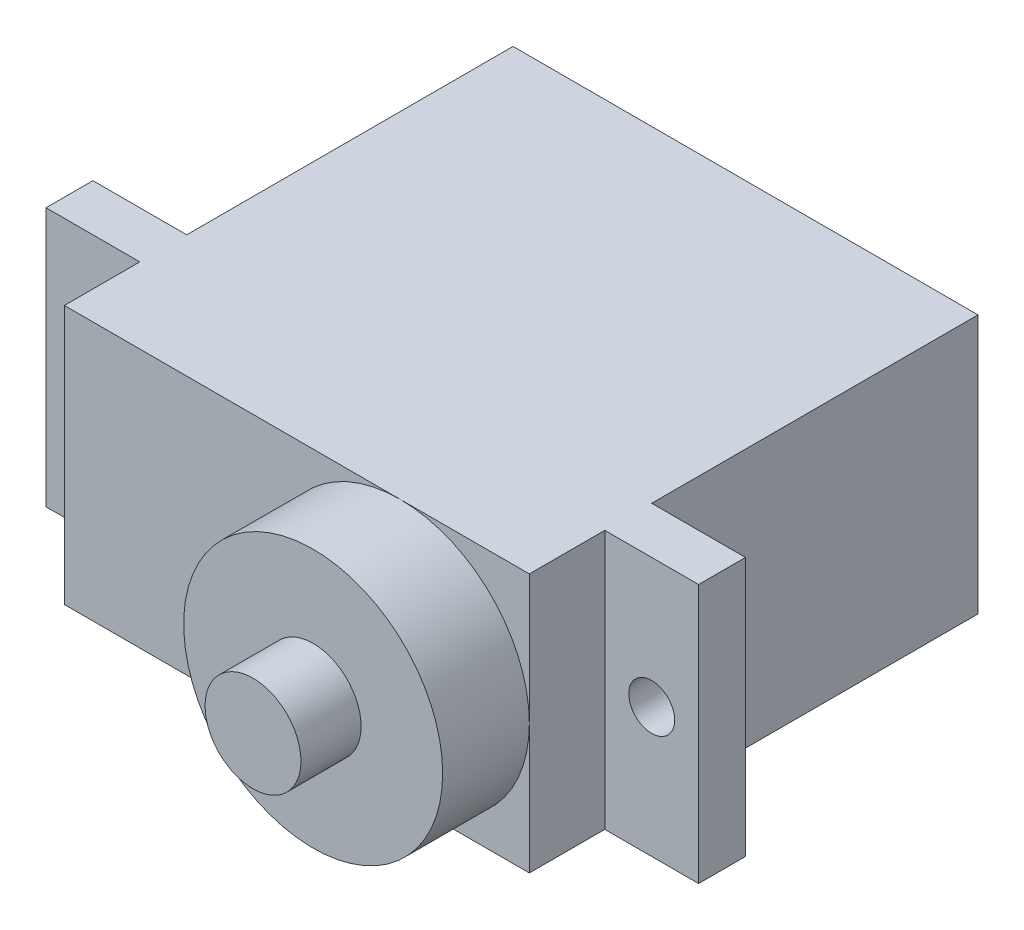
ISO-10303-21;
HEADER;
FILE_DESCRIPTION(('STEP AP214'),'2;1');
FILE_NAME('part.step','',(''),(''),'','','');
FILE_SCHEMA(('AUTOMOTIVE_DESIGN { 1 0 10303 214 1 1 1 1 }'));
ENDSEC;
DATA;
#1=APPLICATION_CONTEXT('core data for automotive mechanical design processes');
#2=APPLICATION_PROTOCOL_DEFINITION('international standard','automotive_design',2000,#1);
#3=PRODUCT_CONTEXT('',#1,'mechanical');
#4=PRODUCT('Part','Part','',(#3));
#5=PRODUCT_RELATED_PRODUCT_CATEGORY('part','',(#4));
#6=PRODUCT_DEFINITION_FORMATION('','',#4);
#7=PRODUCT_DEFINITION_CONTEXT('part definition',#1,'design');
#8=PRODUCT_DEFINITION('design','',#6,#7);
#9=PRODUCT_DEFINITION_SHAPE('','',#8);
#10=(LENGTH_UNIT() NAMED_UNIT(*) SI_UNIT(.MILLI.,.METRE.));
#11=(NAMED_UNIT(*) PLANE_ANGLE_UNIT() SI_UNIT($,.RADIAN.));
#12=(NAMED_UNIT(*) SI_UNIT($,.STERADIAN.) SOLID_ANGLE_UNIT());
#13=UNCERTAINTY_MEASURE_WITH_UNIT(LENGTH_MEASURE(1.E-05),#10,'distance_accuracy_value','');
#14=(GEOMETRIC_REPRESENTATION_CONTEXT(3) GLOBAL_UNCERTAINTY_ASSIGNED_CONTEXT((#13)) GLOBAL_UNIT_ASSIGNED_CONTEXT((#10,
#11,#12)) REPRESENTATION_CONTEXT('',''));
#15=CARTESIAN_POINT('',(0.,0.,0.));
#16=DIRECTION('',(0.,0.,1.));
#17=DIRECTION('',(1.,0.,0.));
#18=AXIS2_PLACEMENT_3D('',#15,#16,#17);
#19=CARTESIAN_POINT('',(0.,0.,22.));
#20=DIRECTION('',(0.,0.,-1.));
#21=DIRECTION('',(-1.,0.,0.));
#22=AXIS2_PLACEMENT_3D('',#19,#20,#21);
#23=PLANE('',#22);
#24=CARTESIAN_POINT('',(5.05,0.,22.));
#25=DIRECTION('',(0.,0.,1.));
#26=DIRECTION('',(1.,0.,0.));
#27=AXIS2_PLACEMENT_3D('',#24,#25,#26);
#28=CIRCLE('',#27,6.35);
#29=CARTESIAN_POINT('',(5.05,-6.35,22.));
#30=VERTEX_POINT('',#29);
#31=CARTESIAN_POINT('',(11.4,0.,22.));
#32=VERTEX_POINT('',#31);
#33=EDGE_CURVE('E168',#30,#32,#28,.T.);
#34=ORIENTED_EDGE('',*,*,#33,.F.);
#35=DIRECTION('',(1.,0.,0.));
#36=VECTOR('',#35,1.);
#37=CARTESIAN_POINT('',(-11.4,-6.35,22.));
#38=LINE('',#37,#36);
#39=CARTESIAN_POINT('',(11.4,-6.35,22.));
#40=VERTEX_POINT('',#39);
#41=EDGE_CURVE('E153',#30,#40,#38,.T.);
#42=ORIENTED_EDGE('',*,*,#41,.T.);
#43=DIRECTION('',(0.,1.,0.));
#44=VECTOR('',#43,1.);
#45=CARTESIAN_POINT('',(11.4,-6.35,22.));
#46=LINE('',#45,#44);
#47=EDGE_CURVE('E166',#40,#32,#46,.T.);
#48=ORIENTED_EDGE('',*,*,#47,.T.);
#49=EDGE_LOOP('',(#34,#42,#48));
#50=FACE_BOUND('',#49,.T.);
#51=ADVANCED_FACE('F43',(#50),#23,.F.);
#52=CARTESIAN_POINT('',(5.05,6.35,22.));
#53=VERTEX_POINT('',#52);
#54=EDGE_CURVE('E68',#32,#53,#28,.T.);
#55=ORIENTED_EDGE('',*,*,#54,.F.);
#56=CARTESIAN_POINT('',(11.4,6.35,22.));
#57=VERTEX_POINT('',#56);
#58=EDGE_CURVE('E277',#32,#57,#46,.T.);
#59=ORIENTED_EDGE('',*,*,#58,.T.);
#60=DIRECTION('',(1.,0.,0.));
#61=VECTOR('',#60,1.);
#62=CARTESIAN_POINT('',(-11.4,6.35,22.));
#63=LINE('',#62,#61);
#64=EDGE_CURVE('E271',#53,#57,#63,.T.);
#65=ORIENTED_EDGE('',*,*,#64,.F.);
#66=EDGE_LOOP('',(#55,#59,#65));
#67=FACE_BOUND('',#66,.T.);
#68=ADVANCED_FACE('F341',(#67),#23,.F.);
#69=CARTESIAN_POINT('',(-11.4,-6.35,22.));
#70=DIRECTION('',(-1.,0.,0.));
#71=DIRECTION('',(0.,0.,1.));
#72=AXIS2_PLACEMENT_3D('',#69,#70,#71);
#73=PLANE('',#72);
#74=DIRECTION('',(0.,0.,-1.));
#75=VECTOR('',#74,1.);
#76=CARTESIAN_POINT('',(-11.4,-6.35,22.));
#77=LINE('',#76,#75);
#78=CARTESIAN_POINT('',(-11.4,-6.35,16.));
#79=VERTEX_POINT('',#78);
#80=CARTESIAN_POINT('',(-11.4,-6.35,0.));
#81=VERTEX_POINT('',#80);
#82=EDGE_CURVE('E53',#79,#81,#77,.T.);
#83=ORIENTED_EDGE('',*,*,#82,.F.);
#84=DIRECTION('',(0.,1.,0.));
#85=VECTOR('',#84,1.);
#86=CARTESIAN_POINT('',(-11.4,0.,16.));
#87=LINE('',#86,#85);
#88=CARTESIAN_POINT('',(-11.4,6.35,16.));
#89=VERTEX_POINT('',#88);
#90=EDGE_CURVE('E188',#79,#89,#87,.T.);
#91=ORIENTED_EDGE('',*,*,#90,.T.);
#92=DIRECTION('',(0.,0.,-1.));
#93=VECTOR('',#92,1.);
#94=CARTESIAN_POINT('',(-11.4,6.35,22.));
#95=LINE('',#94,#93);
#96=CARTESIAN_POINT('',(-11.4,6.35,0.));
#97=VERTEX_POINT('',#96);
#98=EDGE_CURVE('E152',#89,#97,#95,.T.);
#99=ORIENTED_EDGE('',*,*,#98,.T.);
#100=DIRECTION('',(0.,1.,0.));
#101=VECTOR('',#100,1.);
#102=CARTESIAN_POINT('',(-11.4,-6.35,0.));
#103=LINE('',#102,#101);
#104=EDGE_CURVE('E266',#81,#97,#103,.T.);
#105=ORIENTED_EDGE('',*,*,#104,.F.);
#106=EDGE_LOOP('',(#83,#91,#99,#105));
#107=FACE_BOUND('',#106,.T.);
#108=ADVANCED_FACE('F309',(#107),#73,.T.);
#109=CARTESIAN_POINT('',(11.4,-6.35,22.));
#110=DIRECTION('',(-1.,0.,0.));
#111=DIRECTION('',(0.,0.,1.));
#112=AXIS2_PLACEMENT_3D('',#109,#110,#111);
#113=PLANE('',#112);
#114=DIRECTION('',(0.,1.,0.));
#115=VECTOR('',#114,1.);
#116=CARTESIAN_POINT('',(11.4,0.,16.));
#117=LINE('',#116,#115);
#118=CARTESIAN_POINT('',(11.4,-6.35,16.));
#119=VERTEX_POINT('',#118);
#120=CARTESIAN_POINT('',(11.4,6.35,16.));
#121=VERTEX_POINT('',#120);
#122=EDGE_CURVE('E257',#119,#121,#117,.T.);
#123=ORIENTED_EDGE('',*,*,#122,.F.);
#124=DIRECTION('',(0.,0.,-1.));
#125=VECTOR('',#124,1.);
#126=CARTESIAN_POINT('',(11.4,-6.35,22.));
#127=LINE('',#126,#125);
#128=CARTESIAN_POINT('',(11.4,-6.35,0.));
#129=VERTEX_POINT('',#128);
#130=EDGE_CURVE('E295',#119,#129,#127,.T.);
#131=ORIENTED_EDGE('',*,*,#130,.T.);
#132=DIRECTION('',(0.,1.,0.));
#133=VECTOR('',#132,1.);
#134=CARTESIAN_POINT('',(11.4,-6.35,0.));
#135=LINE('',#134,#133);
#136=CARTESIAN_POINT('',(11.4,6.35,0.));
#137=VERTEX_POINT('',#136);
#138=EDGE_CURVE('E287',#129,#137,#135,.T.);
#139=ORIENTED_EDGE('',*,*,#138,.T.);
#140=DIRECTION('',(0.,0.,-1.));
#141=VECTOR('',#140,1.);
#142=CARTESIAN_POINT('',(11.4,6.35,22.));
#143=LINE('',#142,#141);
#144=EDGE_CURVE('E299',#121,#137,#143,.T.);
#145=ORIENTED_EDGE('',*,*,#144,.F.);
#146=EDGE_LOOP('',(#123,#131,#139,#145));
#147=FACE_BOUND('',#146,.T.);
#148=ADVANCED_FACE('F327',(#147),#113,.F.);
#149=DIRECTION('',(0.,1.,0.));
#150=VECTOR('',#149,1.);
#151=CARTESIAN_POINT('',(-11.4,0.,18.3));
#152=LINE('',#151,#150);
#153=CARTESIAN_POINT('',(-11.4,-6.35,18.3));
#154=VERTEX_POINT('',#153);
#155=CARTESIAN_POINT('',(-11.4,6.35,18.3));
#156=VERTEX_POINT('',#155);
#157=EDGE_CURVE('E198',#154,#156,#152,.T.);
#158=ORIENTED_EDGE('',*,*,#157,.F.);
#159=CARTESIAN_POINT('',(-11.4,-6.35,22.));
#160=VERTEX_POINT('',#159);
#161=EDGE_CURVE('E12',#160,#154,#77,.T.);
#162=ORIENTED_EDGE('',*,*,#161,.F.);
#163=DIRECTION('',(0.,1.,0.));
#164=VECTOR('',#163,1.);
#165=CARTESIAN_POINT('',(-11.4,-6.35,22.));
#166=LINE('',#165,#164);
#167=CARTESIAN_POINT('',(-11.4,6.35,22.));
#168=VERTEX_POINT('',#167);
#169=EDGE_CURVE('E149',#160,#168,#166,.T.);
#170=ORIENTED_EDGE('',*,*,#169,.T.);
#171=EDGE_CURVE('E300',#168,#156,#95,.T.);
#172=ORIENTED_EDGE('',*,*,#171,.T.);
#173=EDGE_LOOP('',(#158,#162,#170,#172));
#174=FACE_BOUND('',#173,.T.);
#175=ADVANCED_FACE('F45',(#174),#73,.T.);
#176=CARTESIAN_POINT('',(-11.4,-6.35,22.));
#177=DIRECTION('',(0.,1.,0.));
#178=DIRECTION('',(0.,0.,1.));
#179=AXIS2_PLACEMENT_3D('',#176,#177,#178);
#180=PLANE('',#179);
#181=DIRECTION('',(1.,0.,0.));
#182=VECTOR('',#181,1.);
#183=CARTESIAN_POINT('',(-11.4,-6.35,0.));
#184=LINE('',#183,#182);
#185=EDGE_CURVE('E272',#81,#129,#184,.T.);
#186=ORIENTED_EDGE('',*,*,#185,.T.);
#187=ORIENTED_EDGE('',*,*,#130,.F.);
#188=DIRECTION('',(-1.,0.,0.));
#189=VECTOR('',#188,1.);
#190=CARTESIAN_POINT('',(0.,-6.35,16.));
#191=LINE('',#190,#189);
#192=CARTESIAN_POINT('',(16.,-6.35,16.));
#193=VERTEX_POINT('',#192);
#194=EDGE_CURVE('E254',#193,#119,#191,.T.);
#195=ORIENTED_EDGE('',*,*,#194,.F.);
#196=DIRECTION('',(0.,0.,-1.));
#197=VECTOR('',#196,1.);
#198=CARTESIAN_POINT('',(16.,-6.35,18.3));
#199=LINE('',#198,#197);
#200=CARTESIAN_POINT('',(16.,-6.35,18.3));
#201=VERTEX_POINT('',#200);
#202=EDGE_CURVE('E246',#201,#193,#199,.T.);
#203=ORIENTED_EDGE('',*,*,#202,.F.);
#204=DIRECTION('',(-1.,0.,0.));
#205=VECTOR('',#204,1.);
#206=CARTESIAN_POINT('',(0.,-6.35,18.3));
#207=LINE('',#206,#205);
#208=CARTESIAN_POINT('',(11.4,-6.35,18.3));
#209=VERTEX_POINT('',#208);
#210=EDGE_CURVE('E235',#201,#209,#207,.T.);
#211=ORIENTED_EDGE('',*,*,#210,.T.);
#212=EDGE_CURVE('E161',#40,#209,#127,.T.);
#213=ORIENTED_EDGE('',*,*,#212,.F.);
#214=ORIENTED_EDGE('',*,*,#41,.F.);
#215=EDGE_CURVE('E145',#160,#30,#38,.T.);
#216=ORIENTED_EDGE('',*,*,#215,.F.);
#217=ORIENTED_EDGE('',*,*,#161,.T.);
#218=DIRECTION('',(1.,0.,0.));
#219=VECTOR('',#218,1.);
#220=CARTESIAN_POINT('',(0.,-6.35,18.3));
#221=LINE('',#220,#219);
#222=CARTESIAN_POINT('',(-16.,-6.35,18.3));
#223=VERTEX_POINT('',#222);
#224=EDGE_CURVE('E187',#223,#154,#221,.T.);
#225=ORIENTED_EDGE('',*,*,#224,.F.);
#226=DIRECTION('',(0.,0.,-1.));
#227=VECTOR('',#226,1.);
#228=CARTESIAN_POINT('',(-16.,-6.35,18.3));
#229=LINE('',#228,#227);
#230=CARTESIAN_POINT('',(-16.,-6.35,16.));
#231=VERTEX_POINT('',#230);
#232=EDGE_CURVE('E202',#223,#231,#229,.T.);
#233=ORIENTED_EDGE('',*,*,#232,.T.);
#234=DIRECTION('',(1.,0.,0.));
#235=VECTOR('',#234,1.);
#236=CARTESIAN_POINT('',(0.,-6.35,16.));
#237=LINE('',#236,#235);
#238=EDGE_CURVE('E206',#231,#79,#237,.T.);
#239=ORIENTED_EDGE('',*,*,#238,.T.);
#240=ORIENTED_EDGE('',*,*,#82,.T.);
#241=EDGE_LOOP('',(#186,#187,#195,#203,#211,#213,#214,#216,#217,#225,#233,#239,#240));
#242=FACE_BOUND('',#241,.T.);
#243=ADVANCED_FACE('F158',(#242),#180,.F.);
#244=ORIENTED_EDGE('',*,*,#212,.T.);
#245=DIRECTION('',(0.,1.,0.));
#246=VECTOR('',#245,1.);
#247=CARTESIAN_POINT('',(11.4,0.,18.3));
#248=LINE('',#247,#246);
#249=CARTESIAN_POINT('',(11.4,6.35,18.3));
#250=VERTEX_POINT('',#249);
#251=EDGE_CURVE('E238',#209,#250,#248,.T.);
#252=ORIENTED_EDGE('',*,*,#251,.T.);
#253=EDGE_CURVE('E296',#57,#250,#143,.T.);
#254=ORIENTED_EDGE('',*,*,#253,.F.);
#255=ORIENTED_EDGE('',*,*,#58,.F.);
#256=ORIENTED_EDGE('',*,*,#47,.F.);
#257=EDGE_LOOP('',(#244,#252,#254,#255,#256));
#258=FACE_BOUND('',#257,.T.);
#259=ADVANCED_FACE('F339',(#258),#113,.F.);
#260=CARTESIAN_POINT('',(-11.4,6.35,22.));
#261=DIRECTION('',(0.,1.,0.));
#262=DIRECTION('',(0.,0.,1.));
#263=AXIS2_PLACEMENT_3D('',#260,#261,#262);
#264=PLANE('',#263);
#265=DIRECTION('',(1.,0.,0.));
#266=VECTOR('',#265,1.);
#267=CARTESIAN_POINT('',(-11.4,6.35,0.));
#268=LINE('',#267,#266);
#269=EDGE_CURVE('E283',#97,#137,#268,.T.);
#270=ORIENTED_EDGE('',*,*,#269,.F.);
#271=ORIENTED_EDGE('',*,*,#98,.F.);
#272=DIRECTION('',(-1.,0.,0.));
#273=VECTOR('',#272,1.);
#274=CARTESIAN_POINT('',(0.,6.35,16.));
#275=LINE('',#274,#273);
#276=CARTESIAN_POINT('',(-16.,6.35,16.));
#277=VERTEX_POINT('',#276);
#278=EDGE_CURVE('E213',#89,#277,#275,.T.);
#279=ORIENTED_EDGE('',*,*,#278,.T.);
#280=DIRECTION('',(0.,0.,-1.));
#281=VECTOR('',#280,1.);
#282=CARTESIAN_POINT('',(-16.,6.35,18.3));
#283=LINE('',#282,#281);
#284=CARTESIAN_POINT('',(-16.,6.35,18.3));
#285=VERTEX_POINT('',#284);
#286=EDGE_CURVE('E218',#285,#277,#283,.T.);
#287=ORIENTED_EDGE('',*,*,#286,.F.);
#288=DIRECTION('',(-1.,0.,0.));
#289=VECTOR('',#288,1.);
#290=CARTESIAN_POINT('',(0.,6.35,18.3));
#291=LINE('',#290,#289);
#292=EDGE_CURVE('E195',#156,#285,#291,.T.);
#293=ORIENTED_EDGE('',*,*,#292,.F.);
#294=ORIENTED_EDGE('',*,*,#171,.F.);
#295=EDGE_CURVE('E273',#168,#53,#63,.T.);
#296=ORIENTED_EDGE('',*,*,#295,.T.);
#297=ORIENTED_EDGE('',*,*,#64,.T.);
#298=ORIENTED_EDGE('',*,*,#253,.T.);
#299=DIRECTION('',(1.,0.,0.));
#300=VECTOR('',#299,1.);
#301=CARTESIAN_POINT('',(0.,6.35,18.3));
#302=LINE('',#301,#300);
#303=CARTESIAN_POINT('',(16.,6.35,18.3));
#304=VERTEX_POINT('',#303);
#305=EDGE_CURVE('E242',#250,#304,#302,.T.);
#306=ORIENTED_EDGE('',*,*,#305,.T.);
#307=DIRECTION('',(0.,0.,-1.));
#308=VECTOR('',#307,1.);
#309=CARTESIAN_POINT('',(16.,6.35,18.3));
#310=LINE('',#309,#308);
#311=CARTESIAN_POINT('',(16.,6.35,16.));
#312=VERTEX_POINT('',#311);
#313=EDGE_CURVE('E263',#304,#312,#310,.T.);
#314=ORIENTED_EDGE('',*,*,#313,.T.);
#315=DIRECTION('',(1.,0.,0.));
#316=VECTOR('',#315,1.);
#317=CARTESIAN_POINT('',(0.,6.35,16.));
#318=LINE('',#317,#316);
#319=EDGE_CURVE('E231',#121,#312,#318,.T.);
#320=ORIENTED_EDGE('',*,*,#319,.F.);
#321=ORIENTED_EDGE('',*,*,#144,.T.);
#322=EDGE_LOOP('',(#270,#271,#279,#287,#293,#294,#296,#297,#298,#306,#314,#320,#321));
#323=FACE_BOUND('',#322,.T.);
#324=ADVANCED_FACE('F313',(#323),#264,.T.);
#325=EDGE_CURVE('E61',#53,#30,#28,.T.);
#326=ORIENTED_EDGE('',*,*,#325,.F.);
#327=ORIENTED_EDGE('',*,*,#295,.F.);
#328=ORIENTED_EDGE('',*,*,#169,.F.);
#329=ORIENTED_EDGE('',*,*,#215,.T.);
#330=EDGE_LOOP('',(#326,#327,#328,#329));
#331=FACE_BOUND('',#330,.T.);
#332=ADVANCED_FACE('F147',(#331),#23,.F.);
#333=CARTESIAN_POINT('',(0.,0.,0.));
#334=DIRECTION('',(0.,0.,-1.));
#335=DIRECTION('',(-1.,0.,0.));
#336=AXIS2_PLACEMENT_3D('',#333,#334,#335);
#337=PLANE('',#336);
#338=ORIENTED_EDGE('',*,*,#104,.T.);
#339=ORIENTED_EDGE('',*,*,#269,.T.);
#340=ORIENTED_EDGE('',*,*,#138,.F.);
#341=ORIENTED_EDGE('',*,*,#185,.F.);
#342=EDGE_LOOP('',(#338,#339,#340,#341));
#343=FACE_BOUND('',#342,.T.);
#344=ADVANCED_FACE('F319',(#343),#337,.T.);
#345=CARTESIAN_POINT('',(16.,0.,18.3));
#346=DIRECTION('',(1.,0.,0.));
#347=DIRECTION('',(0.,0.,-1.));
#348=AXIS2_PLACEMENT_3D('',#345,#346,#347);
#349=PLANE('',#348);
#350=DIRECTION('',(0.,-1.,0.));
#351=VECTOR('',#350,1.);
#352=CARTESIAN_POINT('',(16.,0.,16.));
#353=LINE('',#352,#351);
#354=EDGE_CURVE('E250',#312,#193,#353,.T.);
#355=ORIENTED_EDGE('',*,*,#354,.F.);
#356=ORIENTED_EDGE('',*,*,#313,.F.);
#357=DIRECTION('',(0.,-1.,0.));
#358=VECTOR('',#357,1.);
#359=CARTESIAN_POINT('',(16.,0.,18.3));
#360=LINE('',#359,#358);
#361=EDGE_CURVE('E230',#304,#201,#360,.T.);
#362=ORIENTED_EDGE('',*,*,#361,.T.);
#363=ORIENTED_EDGE('',*,*,#202,.T.);
#364=EDGE_LOOP('',(#355,#356,#362,#363));
#365=FACE_BOUND('',#364,.T.);
#366=ADVANCED_FACE('F333',(#365),#349,.T.);
#367=CARTESIAN_POINT('',(13.7,0.,18.3));
#368=DIRECTION('',(0.,0.,-1.));
#369=DIRECTION('',(-1.,0.,0.));
#370=AXIS2_PLACEMENT_3D('',#367,#368,#369);
#371=CYLINDRICAL_SURFACE('',#370,1.125);
#372=CARTESIAN_POINT('',(13.7,0.,18.3));
#373=DIRECTION('',(0.,0.,-1.));
#374=DIRECTION('',(-1.,0.,0.));
#375=AXIS2_PLACEMENT_3D('',#372,#373,#374);
#376=CIRCLE('',#375,1.125);
#377=CARTESIAN_POINT('',(12.575,0.,18.3));
#378=VERTEX_POINT('',#377);
#379=EDGE_CURVE('E226',#378,#378,#376,.T.);
#380=ORIENTED_EDGE('',*,*,#379,.F.);
#381=EDGE_LOOP('',(#380));
#382=FACE_BOUND('',#381,.T.);
#383=CARTESIAN_POINT('',(13.7,0.,16.));
#384=DIRECTION('',(0.,0.,-1.));
#385=DIRECTION('',(-1.,0.,0.));
#386=AXIS2_PLACEMENT_3D('',#383,#384,#385);
#387=CIRCLE('',#386,1.125);
#388=CARTESIAN_POINT('',(12.575,0.,16.));
#389=VERTEX_POINT('',#388);
#390=EDGE_CURVE('E222',#389,#389,#387,.T.);
#391=ORIENTED_EDGE('',*,*,#390,.T.);
#392=EDGE_LOOP('',(#391));
#393=FACE_BOUND('',#392,.T.);
#394=ADVANCED_FACE('F414',(#382,#393),#371,.F.);
#395=CARTESIAN_POINT('',(0.,0.,18.3));
#396=DIRECTION('',(0.,0.,-1.));
#397=DIRECTION('',(-1.,0.,0.));
#398=AXIS2_PLACEMENT_3D('',#395,#396,#397);
#399=PLANE('',#398);
#400=ORIENTED_EDGE('',*,*,#379,.T.);
#401=EDGE_LOOP('',(#400));
#402=FACE_BOUND('',#401,.T.);
#403=ORIENTED_EDGE('',*,*,#361,.F.);
#404=ORIENTED_EDGE('',*,*,#305,.F.);
#405=ORIENTED_EDGE('',*,*,#251,.F.);
#406=ORIENTED_EDGE('',*,*,#210,.F.);
#407=EDGE_LOOP('',(#403,#404,#405,#406));
#408=FACE_BOUND('',#407,.T.);
#409=ADVANCED_FACE('F336',(#402,#408),#399,.F.);
#410=CARTESIAN_POINT('',(0.,0.,16.));
#411=DIRECTION('',(0.,0.,-1.));
#412=DIRECTION('',(-1.,0.,0.));
#413=AXIS2_PLACEMENT_3D('',#410,#411,#412);
#414=PLANE('',#413);
#415=ORIENTED_EDGE('',*,*,#390,.F.);
#416=EDGE_LOOP('',(#415));
#417=FACE_BOUND('',#416,.T.);
#418=ORIENTED_EDGE('',*,*,#354,.T.);
#419=ORIENTED_EDGE('',*,*,#194,.T.);
#420=ORIENTED_EDGE('',*,*,#122,.T.);
#421=ORIENTED_EDGE('',*,*,#319,.T.);
#422=EDGE_LOOP('',(#418,#419,#420,#421));
#423=FACE_BOUND('',#422,.T.);
#424=ADVANCED_FACE('F329',(#417,#423),#414,.T.);
#425=CARTESIAN_POINT('',(-13.7,0.,18.3));
#426=DIRECTION('',(0.,0.,-1.));
#427=DIRECTION('',(-1.,0.,0.));
#428=AXIS2_PLACEMENT_3D('',#425,#426,#427);
#429=CYLINDRICAL_SURFACE('',#428,1.125);
#430=CARTESIAN_POINT('',(-13.7,0.,18.3));
#431=DIRECTION('',(0.,0.,-1.));
#432=DIRECTION('',(-1.,0.,0.));
#433=AXIS2_PLACEMENT_3D('',#430,#431,#432);
#434=CIRCLE('',#433,1.125);
#435=CARTESIAN_POINT('',(-14.825,0.,18.3));
#436=VERTEX_POINT('',#435);
#437=EDGE_CURVE('E183',#436,#436,#434,.T.);
#438=ORIENTED_EDGE('',*,*,#437,.F.);
#439=EDGE_LOOP('',(#438));
#440=FACE_BOUND('',#439,.T.);
#441=CARTESIAN_POINT('',(-13.7,0.,16.));
#442=DIRECTION('',(0.,0.,-1.));
#443=DIRECTION('',(-1.,0.,0.));
#444=AXIS2_PLACEMENT_3D('',#441,#442,#443);
#445=CIRCLE('',#444,1.125);
#446=CARTESIAN_POINT('',(-14.825,0.,16.));
#447=VERTEX_POINT('',#446);
#448=EDGE_CURVE('E182',#447,#447,#445,.T.);
#449=ORIENTED_EDGE('',*,*,#448,.T.);
#450=EDGE_LOOP('',(#449));
#451=FACE_BOUND('',#450,.T.);
#452=ADVANCED_FACE('F441',(#440,#451),#429,.F.);
#453=CARTESIAN_POINT('',(-16.,0.,18.3));
#454=DIRECTION('',(1.,0.,0.));
#455=DIRECTION('',(0.,0.,-1.));
#456=AXIS2_PLACEMENT_3D('',#453,#454,#455);
#457=PLANE('',#456);
#458=DIRECTION('',(0.,-1.,0.));
#459=VECTOR('',#458,1.);
#460=CARTESIAN_POINT('',(-16.,0.,16.));
#461=LINE('',#460,#459);
#462=EDGE_CURVE('E210',#277,#231,#461,.T.);
#463=ORIENTED_EDGE('',*,*,#462,.T.);
#464=ORIENTED_EDGE('',*,*,#232,.F.);
#465=DIRECTION('',(0.,-1.,0.));
#466=VECTOR('',#465,1.);
#467=CARTESIAN_POINT('',(-16.,0.,18.3));
#468=LINE('',#467,#466);
#469=EDGE_CURVE('E192',#285,#223,#468,.T.);
#470=ORIENTED_EDGE('',*,*,#469,.F.);
#471=ORIENTED_EDGE('',*,*,#286,.T.);
#472=EDGE_LOOP('',(#463,#464,#470,#471));
#473=FACE_BOUND('',#472,.T.);
#474=ADVANCED_FACE('F451',(#473),#457,.F.);
#475=CARTESIAN_POINT('',(0.,0.,18.3));
#476=DIRECTION('',(0.,0.,-1.));
#477=DIRECTION('',(-1.,0.,0.));
#478=AXIS2_PLACEMENT_3D('',#475,#476,#477);
#479=PLANE('',#478);
#480=ORIENTED_EDGE('',*,*,#437,.T.);
#481=EDGE_LOOP('',(#480));
#482=FACE_BOUND('',#481,.T.);
#483=ORIENTED_EDGE('',*,*,#224,.T.);
#484=ORIENTED_EDGE('',*,*,#157,.T.);
#485=ORIENTED_EDGE('',*,*,#292,.T.);
#486=ORIENTED_EDGE('',*,*,#469,.T.);
#487=EDGE_LOOP('',(#483,#484,#485,#486));
#488=FACE_BOUND('',#487,.T.);
#489=ADVANCED_FACE('F361',(#482,#488),#479,.F.);
#490=CARTESIAN_POINT('',(0.,0.,16.));
#491=DIRECTION('',(0.,0.,-1.));
#492=DIRECTION('',(-1.,0.,0.));
#493=AXIS2_PLACEMENT_3D('',#490,#491,#492);
#494=PLANE('',#493);
#495=ORIENTED_EDGE('',*,*,#448,.F.);
#496=EDGE_LOOP('',(#495));
#497=FACE_BOUND('',#496,.T.);
#498=ORIENTED_EDGE('',*,*,#238,.F.);
#499=ORIENTED_EDGE('',*,*,#462,.F.);
#500=ORIENTED_EDGE('',*,*,#278,.F.);
#501=ORIENTED_EDGE('',*,*,#90,.F.);
#502=EDGE_LOOP('',(#498,#499,#500,#501));
#503=FACE_BOUND('',#502,.T.);
#504=ADVANCED_FACE('F352',(#497,#503),#494,.T.);
#505=CARTESIAN_POINT('',(5.05,0.,26.25));
#506=DIRECTION('',(0.,0.,-1.));
#507=DIRECTION('',(-1.,0.,0.));
#508=AXIS2_PLACEMENT_3D('',#505,#506,#507);
#509=CYLINDRICAL_SURFACE('',#508,6.35);
#510=CARTESIAN_POINT('',(5.05,0.,26.25));
#511=DIRECTION('',(0.,0.,1.));
#512=DIRECTION('',(1.,0.,0.));
#513=AXIS2_PLACEMENT_3D('',#510,#511,#512);
#514=CIRCLE('',#513,6.35);
#515=CARTESIAN_POINT('',(11.4,0.,26.25));
#516=VERTEX_POINT('',#515);
#517=EDGE_CURVE('E175',#516,#516,#514,.T.);
#518=ORIENTED_EDGE('',*,*,#517,.F.);
#519=EDGE_LOOP('',(#518));
#520=FACE_BOUND('',#519,.T.);
#521=ORIENTED_EDGE('',*,*,#54,.T.);
#522=ORIENTED_EDGE('',*,*,#325,.T.);
#523=ORIENTED_EDGE('',*,*,#33,.T.);
#524=EDGE_LOOP('',(#521,#522,#523));
#525=FACE_BOUND('',#524,.T.);
#526=ADVANCED_FACE('F172',(#520,#525),#509,.T.);
#527=CARTESIAN_POINT('',(5.05,0.,26.25));
#528=DIRECTION('',(0.,0.,1.));
#529=DIRECTION('',(1.,0.,0.));
#530=AXIS2_PLACEMENT_3D('',#527,#528,#529);
#531=PLANE('',#530);
#532=CARTESIAN_POINT('',(5.05,0.,26.25));
#533=DIRECTION('',(0.,0.,1.));
#534=DIRECTION('',(1.,0.,0.));
#535=AXIS2_PLACEMENT_3D('',#532,#533,#534);
#536=CIRCLE('',#535,2.35);
#537=CARTESIAN_POINT('',(7.4,0.,26.25));
#538=VERTEX_POINT('',#537);
#539=EDGE_CURVE('E47',#538,#538,#536,.T.);
#540=ORIENTED_EDGE('',*,*,#539,.F.);
#541=EDGE_LOOP('',(#540));
#542=FACE_BOUND('',#541,.T.);
#543=ORIENTED_EDGE('',*,*,#517,.T.);
#544=EDGE_LOOP('',(#543));
#545=FACE_BOUND('',#544,.T.);
#546=ADVANCED_FACE('F349',(#542,#545),#531,.T.);
#547=CARTESIAN_POINT('',(0.,0.,29.2));
#548=DIRECTION('',(0.,0.,-1.));
#549=DIRECTION('',(-1.,0.,0.));
#550=AXIS2_PLACEMENT_3D('',#547,#548,#549);
#551=PLANE('',#550);
#552=CARTESIAN_POINT('',(5.05,0.,29.2));
#553=DIRECTION('',(0.,0.,-1.));
#554=DIRECTION('',(-1.,0.,0.));
#555=AXIS2_PLACEMENT_3D('',#552,#553,#554);
#556=CIRCLE('',#555,2.35);
#557=CARTESIAN_POINT('',(2.7,0.,29.2));
#558=VERTEX_POINT('',#557);
#559=EDGE_CURVE('E178',#558,#558,#556,.T.);
#560=ORIENTED_EDGE('',*,*,#559,.F.);
#561=EDGE_LOOP('',(#560));
#562=FACE_BOUND('',#561,.T.);
#563=ADVANCED_FACE('F358',(#562),#551,.F.);
#564=CARTESIAN_POINT('',(5.05,0.,65.0468037431535));
#565=DIRECTION('',(0.,0.,-1.));
#566=DIRECTION('',(-1.,0.,0.));
#567=AXIS2_PLACEMENT_3D('',#564,#565,#566);
#568=CYLINDRICAL_SURFACE('',#567,2.35);
#569=ORIENTED_EDGE('',*,*,#539,.T.);
#570=EDGE_LOOP('',(#569));
#571=FACE_BOUND('',#570,.T.);
#572=ORIENTED_EDGE('',*,*,#559,.T.);
#573=EDGE_LOOP('',(#572));
#574=FACE_BOUND('',#573,.T.);
#575=ADVANCED_FACE('F485',(#571,#574),#568,.T.);
#576=CLOSED_SHELL('',(#51,#68,#108,#148,#175,#243,#259,#324,#332,#344,#366,#394,#409,#424,#452,
#474,#489,#504,#526,#546,#563,#575));
#577=MANIFOLD_SOLID_BREP('B2',#576);
#578=ADVANCED_BREP_SHAPE_REPRESENTATION('',(#18,#577),#14);
#579=SHAPE_DEFINITION_REPRESENTATION(#9,#578);
ENDSEC;
END-ISO-10303-21;
